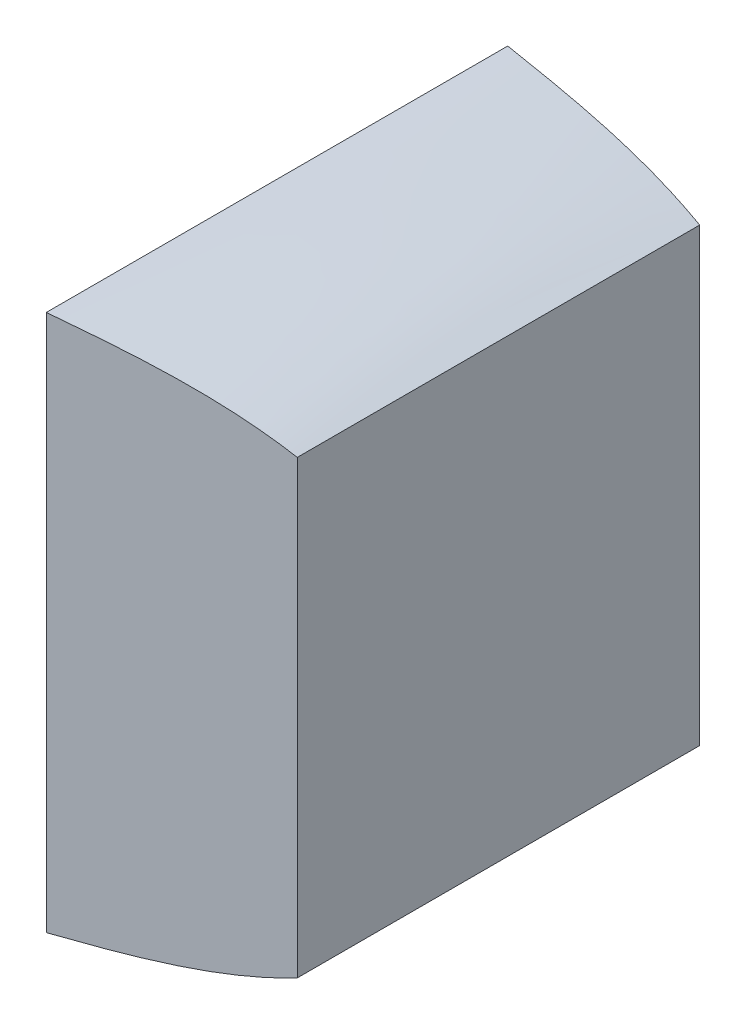
ISO-10303-21;
HEADER;
FILE_DESCRIPTION(('STEP AP214'),'2;1');
FILE_NAME('part.step','',(''),(''),'','','');
FILE_SCHEMA(('AUTOMOTIVE_DESIGN { 1 0 10303 214 1 1 1 1 }'));
ENDSEC;
DATA;
#1=APPLICATION_CONTEXT('core data for automotive mechanical design processes');
#2=APPLICATION_PROTOCOL_DEFINITION('international standard','automotive_design',2000,#1);
#3=PRODUCT_CONTEXT('',#1,'mechanical');
#4=PRODUCT('Part','Part','',(#3));
#5=PRODUCT_RELATED_PRODUCT_CATEGORY('part','',(#4));
#6=PRODUCT_DEFINITION_FORMATION('','',#4);
#7=PRODUCT_DEFINITION_CONTEXT('part definition',#1,'design');
#8=PRODUCT_DEFINITION('design','',#6,#7);
#9=PRODUCT_DEFINITION_SHAPE('','',#8);
#10=(LENGTH_UNIT() NAMED_UNIT(*) SI_UNIT(.MILLI.,.METRE.));
#11=(NAMED_UNIT(*) PLANE_ANGLE_UNIT() SI_UNIT($,.RADIAN.));
#12=(NAMED_UNIT(*) SI_UNIT($,.STERADIAN.) SOLID_ANGLE_UNIT());
#13=UNCERTAINTY_MEASURE_WITH_UNIT(LENGTH_MEASURE(1.E-05),#10,'distance_accuracy_value','');
#14=(GEOMETRIC_REPRESENTATION_CONTEXT(3) GLOBAL_UNCERTAINTY_ASSIGNED_CONTEXT((#13)) GLOBAL_UNIT_ASSIGNED_CONTEXT((#10,
#11,#12)) REPRESENTATION_CONTEXT('',''));
#15=CARTESIAN_POINT('',(0.,0.,0.));
#16=DIRECTION('',(0.,0.,1.));
#17=DIRECTION('',(1.,0.,0.));
#18=AXIS2_PLACEMENT_3D('',#15,#16,#17);
#19=CARTESIAN_POINT('',(120.,0.,0.));
#20=DIRECTION('',(-1.,0.,0.));
#21=DIRECTION('',(0.,0.,1.));
#22=AXIS2_PLACEMENT_3D('',#19,#20,#21);
#23=PLANE('',#22);
#24=DIRECTION('',(0.,0.,1.));
#25=VECTOR('',#24,1.);
#26=CARTESIAN_POINT('',(120.,129.5,109.));
#27=LINE('',#26,#25);
#28=CARTESIAN_POINT('',(120.,129.5,-109.));
#29=VERTEX_POINT('',#28);
#30=CARTESIAN_POINT('',(120.,129.5,109.));
#31=VERTEX_POINT('',#30);
#32=EDGE_CURVE('E221',#29,#31,#27,.T.);
#33=ORIENTED_EDGE('',*,*,#32,.T.);
#34=DIRECTION('',(0.,-1.,0.));
#35=VECTOR('',#34,1.);
#36=CARTESIAN_POINT('',(120.,129.5,109.));
#37=LINE('',#36,#35);
#38=CARTESIAN_POINT('',(120.,-114.75,109.));
#39=VERTEX_POINT('',#38);
#40=EDGE_CURVE('E223',#31,#39,#37,.T.);
#41=ORIENTED_EDGE('',*,*,#40,.T.);
#42=DIRECTION('',(0.,0.,-1.));
#43=VECTOR('',#42,1.);
#44=CARTESIAN_POINT('',(120.,-114.75,109.));
#45=LINE('',#44,#43);
#46=CARTESIAN_POINT('',(120.,-114.75,-109.));
#47=VERTEX_POINT('',#46);
#48=EDGE_CURVE('E184',#39,#47,#45,.T.);
#49=ORIENTED_EDGE('',*,*,#48,.T.);
#50=DIRECTION('',(0.,1.,0.));
#51=VECTOR('',#50,1.);
#52=CARTESIAN_POINT('',(120.,129.5,-109.));
#53=LINE('',#52,#51);
#54=EDGE_CURVE('E189',#47,#29,#53,.T.);
#55=ORIENTED_EDGE('',*,*,#54,.T.);
#56=EDGE_LOOP('',(#33,#41,#49,#55));
#57=FACE_BOUND('',#56,.T.);
#58=ADVANCED_FACE('F147',(#57),#23,.F.);
#59=CARTESIAN_POINT('',(0.,0.,0.));
#60=DIRECTION('',(1.,0.,0.));
#61=DIRECTION('',(0.,0.,-1.));
#62=AXIS2_PLACEMENT_3D('',#59,#60,#61);
#63=PLANE('',#62);
#64=DIRECTION('',(0.,-1.,0.));
#65=VECTOR('',#64,1.);
#66=CARTESIAN_POINT('',(0.,145.5,125.));
#67=LINE('',#66,#65);
#68=CARTESIAN_POINT('',(0.,145.5,125.));
#69=VERTEX_POINT('',#68);
#70=CARTESIAN_POINT('',(0.,-145.5,125.));
#71=VERTEX_POINT('',#70);
#72=EDGE_CURVE('E202',#69,#71,#67,.T.);
#73=ORIENTED_EDGE('',*,*,#72,.F.);
#74=DIRECTION('',(0.,0.,1.));
#75=VECTOR('',#74,1.);
#76=CARTESIAN_POINT('',(0.,145.5,125.));
#77=LINE('',#76,#75);
#78=CARTESIAN_POINT('',(0.,145.5,-125.));
#79=VERTEX_POINT('',#78);
#80=EDGE_CURVE('E15',#79,#69,#77,.T.);
#81=ORIENTED_EDGE('',*,*,#80,.F.);
#82=DIRECTION('',(0.,1.,0.));
#83=VECTOR('',#82,1.);
#84=CARTESIAN_POINT('',(0.,145.5,-125.));
#85=LINE('',#84,#83);
#86=CARTESIAN_POINT('',(0.,-145.5,-125.));
#87=VERTEX_POINT('',#86);
#88=EDGE_CURVE('E158',#87,#79,#85,.T.);
#89=ORIENTED_EDGE('',*,*,#88,.F.);
#90=DIRECTION('',(0.,0.,-1.));
#91=VECTOR('',#90,1.);
#92=CARTESIAN_POINT('',(0.,-145.5,125.));
#93=LINE('',#92,#91);
#94=EDGE_CURVE('E167',#71,#87,#93,.T.);
#95=ORIENTED_EDGE('',*,*,#94,.F.);
#96=EDGE_LOOP('',(#73,#81,#89,#95));
#97=FACE_BOUND('',#96,.T.);
#98=ADVANCED_FACE('F200',(#97),#63,.F.);
#99=CARTESIAN_POINT('',(0.,-145.5,125.));
#100=CARTESIAN_POINT('',(13.0891040272464,-143.424539708883,123.293126776865));
#101=CARTESIAN_POINT('',(54.3080287417542,-136.65022643676,117.959793443532));
#102=CARTESIAN_POINT('',(94.731450249176,-126.291251244197,112.626460110199));
#103=CARTESIAN_POINT('',(120.,-114.75,109.));
#104=CARTESIAN_POINT('',(0.,-145.5,114.443669442892));
#105=CARTESIAN_POINT('',(13.0916315601428,-143.495090170189,112.906665428313));
#106=CARTESIAN_POINT('',(54.3261197229623,-136.929789132152,108.104109132206));
#107=CARTESIAN_POINT('',(94.7443238380566,-126.570028362689,103.301552836099));
#108=CARTESIAN_POINT('',(120.,-114.75,100.036000554571));
#109=CARTESIAN_POINT('',(0.,-145.5,93.4739085944704));
#110=CARTESIAN_POINT('',(13.0962471571785,-143.623924299521,92.2489590891581));
#111=CARTESIAN_POINT('',(54.3591561591465,-137.440306225704,88.4214551247255));
#112=CARTESIAN_POINT('',(94.7678326512393,-127.079110892751,84.5939511602929));
#113=CARTESIAN_POINT('',(120.,-114.75,81.9913967011725));
#114=CARTESIAN_POINT('',(0.,-145.5,62.277139001304));
#115=CARTESIAN_POINT('',(13.1015635247602,-143.772318880611,61.4685437253229));
#116=CARTESIAN_POINT('',(54.3972084061225,-138.028333409412,58.9419892746967));
#117=CARTESIAN_POINT('',(94.7949107283164,-127.665485708027,56.4154348240705));
#118=CARTESIAN_POINT('',(120.,-114.75,54.6974756494253));
#119=CARTESIAN_POINT('',(0.,-145.5,31.1813203106448));
#120=CARTESIAN_POINT('',(13.1049842426695,-143.867800615721,30.7684000788011));
#121=CARTESIAN_POINT('',(54.4216924171921,-138.406688571574,29.4781805085065));
#122=CARTESIAN_POINT('',(94.8123336137326,-128.042777684434,28.187960938212));
#123=CARTESIAN_POINT('',(120.,-114.75,27.3106615997612));
#124=CARTESIAN_POINT('',(0.,-145.5,10.4166666666667));
#125=CARTESIAN_POINT('',(13.1058085403606,-143.890809053094,10.2744272314054));
#126=CARTESIAN_POINT('',(54.4275923815644,-138.497861622038,9.82998278696101));
#127=CARTESIAN_POINT('',(94.8165320435948,-128.133694536758,9.38553834251658));
#128=CARTESIAN_POINT('',(120.,-114.75,9.08333333333336));
#129=CARTESIAN_POINT('',(0.,-145.5,0.));
#130=CARTESIAN_POINT('',(13.1058085403606,-143.890809053094,0.));
#131=CARTESIAN_POINT('',(54.4275923815644,-138.497861622038,0.));
#132=CARTESIAN_POINT('',(94.8165320435948,-128.133694536758,0.));
#133=CARTESIAN_POINT('',(120.,-114.75,0.));
#134=CARTESIAN_POINT('',(0.,-145.5,-10.4166666666667));
#135=CARTESIAN_POINT('',(13.1058085403606,-143.890809053094,-10.2744272314054));
#136=CARTESIAN_POINT('',(54.4275923815644,-138.497861622038,-9.829982786961));
#137=CARTESIAN_POINT('',(94.8165320435948,-128.133694536758,-9.38553834251656));
#138=CARTESIAN_POINT('',(120.,-114.75,-9.08333333333334));
#139=CARTESIAN_POINT('',(0.,-145.5,-31.1813203106449));
#140=CARTESIAN_POINT('',(13.1049842426695,-143.867800615721,-30.7684000788011));
#141=CARTESIAN_POINT('',(54.4216924171921,-138.406688571574,-29.4781805085066));
#142=CARTESIAN_POINT('',(94.8123336137326,-128.042777684434,-28.187960938212));
#143=CARTESIAN_POINT('',(120.,-114.75,-27.3106615997613));
#144=CARTESIAN_POINT('',(0.,-145.5,-62.277139001304));
#145=CARTESIAN_POINT('',(13.1015635247602,-143.772318880611,-61.4685437253229));
#146=CARTESIAN_POINT('',(54.3972084061225,-138.028333409411,-58.9419892746967));
#147=CARTESIAN_POINT('',(94.7949107283164,-127.665485708027,-56.4154348240705));
#148=CARTESIAN_POINT('',(120.,-114.75,-54.6974756494253));
#149=CARTESIAN_POINT('',(0.,-145.5,-93.4739085944704));
#150=CARTESIAN_POINT('',(13.0962471571785,-143.623924299522,-92.2489590891582));
#151=CARTESIAN_POINT('',(54.3591561591465,-137.440306225705,-88.4214551247256));
#152=CARTESIAN_POINT('',(94.7678326512394,-127.079110892751,-84.593951160293));
#153=CARTESIAN_POINT('',(120.,-114.75,-81.9913967011726));
#154=CARTESIAN_POINT('',(0.,-145.5,-114.443669442892));
#155=CARTESIAN_POINT('',(13.0916315601428,-143.495090170189,-112.906665428313));
#156=CARTESIAN_POINT('',(54.3261197229622,-136.929789132152,-108.104109132206));
#157=CARTESIAN_POINT('',(94.7443238380566,-126.570028362689,-103.301552836099));
#158=CARTESIAN_POINT('',(120.,-114.75,-100.036000554571));
#159=CARTESIAN_POINT('',(0.,-145.5,-125.));
#160=CARTESIAN_POINT('',(13.0891040272464,-143.424539708883,-123.293126776865));
#161=CARTESIAN_POINT('',(54.3080287417542,-136.65022643676,-117.959793443532));
#162=CARTESIAN_POINT('',(94.7314502491761,-126.291251244197,-112.626460110199));
#163=CARTESIAN_POINT('',(120.,-114.75,-109.));
#164=B_SPLINE_SURFACE_WITH_KNOTS('',3,3,((#99,#100,#101,#102,#103),(#104,#105,#106,#107,#108),
(#109,#110,#111,#112,#113),(#114,#115,#116,#117,#118),(#119,#120,#121,#122,#123),(#124,#125,
#126,#127,#128),(#129,#130,#131,#132,#133),(#134,#135,#136,#137,#138),(#139,#140,#141,#142,
#143),(#144,#145,#146,#147,#148),(#149,#150,#151,#152,#153),(#154,#155,#156,#157,#158),(#159,
#160,#161,#162,#163)),.UNSPECIFIED.,.F.,.F.,.F.,(4,1,1,1,3,1,1,1,4),(4,1,4),(0.766571629366526,
0.79575017569571,0.824928722024894,0.854107268354079,0.883285814683263,0.912464361012447,
0.941642907341631,0.970821453670816,1.),(0.,0.320038729337755,1.),.UNSPECIFIED.);
#165=CARTESIAN_POINT('',(0.,-145.5,-125.));
#166=CARTESIAN_POINT('',(13.0891040272464,-143.424539708883,-123.293126776865));
#167=CARTESIAN_POINT('',(54.3080287417542,-136.65022643676,-117.959793443532));
#168=CARTESIAN_POINT('',(94.7314502491761,-126.291251244197,-112.626460110199));
#169=CARTESIAN_POINT('',(120.,-114.75,-109.));
#170=B_SPLINE_CURVE_WITH_KNOTS('',3,(#165,#166,#167,#168,#169),.UNSPECIFIED.,.F.,.F.,(4,1,4),
(0.,0.320038729337755,1.),.UNSPECIFIED.);
#171=EDGE_CURVE('E216',#87,#47,#170,.T.);
#172=CARTESIAN_POINT('',(0.,-145.5,125.));
#173=CARTESIAN_POINT('',(13.0891040272464,-143.424539708883,123.293126776865));
#174=CARTESIAN_POINT('',(54.3080287417542,-136.65022643676,117.959793443532));
#175=CARTESIAN_POINT('',(94.731450249176,-126.291251244197,112.626460110199));
#176=CARTESIAN_POINT('',(120.,-114.75,109.));
#177=B_SPLINE_CURVE_WITH_KNOTS('',3,(#172,#173,#174,#175,#176),.UNSPECIFIED.,.F.,.F.,(4,1,4),
(0.,0.320038729337755,1.),.UNSPECIFIED.);
#178=EDGE_CURVE('E225',#71,#39,#177,.T.);
#179=ORIENTED_EDGE('',*,*,#94,.T.);
#180=ORIENTED_EDGE('',*,*,#171,.T.);
#181=ORIENTED_EDGE('',*,*,#48,.F.);
#182=ORIENTED_EDGE('',*,*,#178,.F.);
#183=EDGE_LOOP('',(#179,#180,#181,#182));
#184=FACE_BOUND('',#183,.T.);
#185=ADVANCED_FACE('F265',(#184),#164,.T.);
#186=CARTESIAN_POINT('',(0.,145.5,125.));
#187=CARTESIAN_POINT('',(13.0014903659114,145.033730655789,123.293126776865));
#188=CARTESIAN_POINT('',(53.6809282585079,143.469849566995,117.959793443532));
#189=CARTESIAN_POINT('',(94.2852039281364,138.218260418227,112.626460110199));
#190=CARTESIAN_POINT('',(120.,129.5,109.));
#191=CARTESIAN_POINT('',(0.,121.25,125.));
#192=CARTESIAN_POINT('',(13.0072631737381,121.038201409973,123.293126776865));
#193=CARTESIAN_POINT('',(53.7222475062445,120.295553882622,117.959793443532));
#194=CARTESIAN_POINT('',(94.3146068113795,116.344370078578,112.626460110199));
#195=CARTESIAN_POINT('',(120.,109.145833333333,109.));
#196=CARTESIAN_POINT('',(0.,72.7500000000001,125.));
#197=CARTESIAN_POINT('',(13.0211012853184,72.9831529914806,123.293126776865));
#198=CARTESIAN_POINT('',(53.8212946905186,73.6933965399663,117.959793443532));
#199=CARTESIAN_POINT('',(94.3850890431311,72.3437359509502,112.626460110199));
#200=CARTESIAN_POINT('',(120.,68.4375000000001,109.));
#201=CARTESIAN_POINT('',(0.,0.,125.));
#202=CARTESIAN_POINT('',(13.0452971965789,0.804595473452866,123.293126776865));
#203=CARTESIAN_POINT('',(53.9944785001309,3.40981156511738,117.959793443532));
#204=CARTESIAN_POINT('',(94.508327088656,5.96350458701466,112.626460110199));
#205=CARTESIAN_POINT('',(120.,7.37500000000002,109.));
#206=CARTESIAN_POINT('',(0.,-72.75,125.));
#207=CARTESIAN_POINT('',(13.0694931078395,-71.3739620445749,123.293126776865));
#208=CARTESIAN_POINT('',(54.1676623097435,-66.8737734097315,117.959793443532));
#209=CARTESIAN_POINT('',(94.6315651341814,-60.4167267769209,112.626460110199));
#210=CARTESIAN_POINT('',(120.,-53.6875,109.));
#211=CARTESIAN_POINT('',(0.,-121.25,125.));
#212=CARTESIAN_POINT('',(13.0833312194197,-119.429010463067,123.293126776865));
#213=CARTESIAN_POINT('',(54.2667094940175,-113.475930752387,117.959793443532));
#214=CARTESIAN_POINT('',(94.7020473659329,-104.417360904548,112.626460110199));
#215=CARTESIAN_POINT('',(120.,-94.3958333333333,109.));
#216=CARTESIAN_POINT('',(0.,-145.5,125.));
#217=CARTESIAN_POINT('',(13.0891040272464,-143.424539708883,123.293126776865));
#218=CARTESIAN_POINT('',(54.3080287417542,-136.65022643676,117.959793443532));
#219=CARTESIAN_POINT('',(94.731450249176,-126.291251244197,112.626460110199));
#220=CARTESIAN_POINT('',(120.,-114.75,109.));
#221=B_SPLINE_SURFACE_WITH_KNOTS('',3,3,((#186,#187,#188,#189,#190),(#191,#192,#193,#194,#195),
(#196,#197,#198,#199,#200),(#201,#202,#203,#204,#205),(#206,#207,#208,#209,#210),(#211,#212,
#213,#214,#215),(#216,#217,#218,#219,#220)),.UNSPECIFIED.,.F.,.F.,.F.,(4,1,1,1,4),(4,1,4),(0.5,
0.566642907341631,0.633285814683263,0.699928722024894,0.766571629366526),(0.,0.320038729337755,
1.),.UNSPECIFIED.);
#222=CARTESIAN_POINT('',(0.,145.5,125.));
#223=CARTESIAN_POINT('',(13.0014903659114,145.033730655789,123.293126776865));
#224=CARTESIAN_POINT('',(53.6809282585079,143.469849566995,117.959793443532));
#225=CARTESIAN_POINT('',(94.2852039281364,138.218260418227,112.626460110199));
#226=CARTESIAN_POINT('',(120.,129.5,109.));
#227=B_SPLINE_CURVE_WITH_KNOTS('',3,(#222,#223,#224,#225,#226),.UNSPECIFIED.,.F.,.F.,(4,1,4),
(0.,0.320038729337755,1.),.UNSPECIFIED.);
#228=EDGE_CURVE('E196',#69,#31,#227,.T.);
#229=ORIENTED_EDGE('',*,*,#72,.T.);
#230=ORIENTED_EDGE('',*,*,#178,.T.);
#231=ORIENTED_EDGE('',*,*,#40,.F.);
#232=ORIENTED_EDGE('',*,*,#228,.F.);
#233=EDGE_LOOP('',(#229,#230,#231,#232));
#234=FACE_BOUND('',#233,.T.);
#235=ADVANCED_FACE('F255',(#234),#221,.T.);
#236=CARTESIAN_POINT('',(0.,145.5,-125.));
#237=CARTESIAN_POINT('',(13.0014903659114,145.033730655789,-123.293126776865));
#238=CARTESIAN_POINT('',(53.6809282585079,143.469849566995,-117.959793443532));
#239=CARTESIAN_POINT('',(94.2852039281364,138.218260418227,-112.626460110199));
#240=CARTESIAN_POINT('',(120.,129.5,-109.));
#241=CARTESIAN_POINT('',(0.,145.5,-114.443669442892));
#242=CARTESIAN_POINT('',(12.998962833015,145.104281117095,-112.906665428313));
#243=CARTESIAN_POINT('',(53.6628372772998,143.749412262387,-108.104109132206));
#244=CARTESIAN_POINT('',(94.2723303392558,138.497037536718,-103.301552836099));
#245=CARTESIAN_POINT('',(120.,129.5,-100.036000554571));
#246=CARTESIAN_POINT('',(0.,145.5,-93.4739085944704));
#247=CARTESIAN_POINT('',(12.9943472359793,145.233115246427,-92.2489590891581));
#248=CARTESIAN_POINT('',(53.6298008411154,144.259929355939,-88.4214551247255));
#249=CARTESIAN_POINT('',(94.2488215260729,139.00612006678,-84.5939511602929));
#250=CARTESIAN_POINT('',(120.,129.5,-81.9913967011725));
#251=CARTESIAN_POINT('',(0.,145.5,-62.2771390013041));
#252=CARTESIAN_POINT('',(12.9890308683976,145.381509827517,-61.468543725323));
#253=CARTESIAN_POINT('',(53.5917485941396,144.847956539646,-58.9419892746968));
#254=CARTESIAN_POINT('',(94.2217434489962,139.592494882056,-56.4154348240705));
#255=CARTESIAN_POINT('',(120.,129.5,-54.6974756494253));
#256=CARTESIAN_POINT('',(0.,145.5,-31.1813203106449));
#257=CARTESIAN_POINT('',(12.9856101504883,145.476991562627,-30.7684000788011));
#258=CARTESIAN_POINT('',(53.5672645830699,145.226311701809,-29.4781805085065));
#259=CARTESIAN_POINT('',(94.2043205635798,139.969786858463,-28.1879609382119));
#260=CARTESIAN_POINT('',(120.,129.5,-27.3106615997611));
#261=CARTESIAN_POINT('',(0.,145.5,-10.4166666666667));
#262=CARTESIAN_POINT('',(12.9847858527973,145.5,-10.2744272314055));
#263=CARTESIAN_POINT('',(53.5613646186976,145.317484752272,-9.82998278696101));
#264=CARTESIAN_POINT('',(94.2001221337177,140.060703710787,-9.38553834251656));
#265=CARTESIAN_POINT('',(120.,129.5,-9.08333333333334));
#266=CARTESIAN_POINT('',(0.,145.5,10.4166666666667));
#267=CARTESIAN_POINT('',(12.9847858527973,145.5,10.2744272314054));
#268=CARTESIAN_POINT('',(53.5613646186976,145.317484752272,9.82998278696099));
#269=CARTESIAN_POINT('',(94.2001221337177,140.060703710787,9.38553834251654));
#270=CARTESIAN_POINT('',(120.,129.5,9.08333333333332));
#271=CARTESIAN_POINT('',(0.,145.5,31.1813203106448));
#272=CARTESIAN_POINT('',(12.9856101504883,145.476991562627,30.7684000788011));
#273=CARTESIAN_POINT('',(53.5672645830699,145.226311701809,29.4781805085065));
#274=CARTESIAN_POINT('',(94.2043205635798,139.969786858463,28.187960938212));
#275=CARTESIAN_POINT('',(120.,129.5,27.3106615997612));
#276=CARTESIAN_POINT('',(0.,145.5,62.2771390013041));
#277=CARTESIAN_POINT('',(12.9890308683976,145.381509827517,61.468543725323));
#278=CARTESIAN_POINT('',(53.5917485941396,144.847956539646,58.9419892746968));
#279=CARTESIAN_POINT('',(94.2217434489961,139.592494882056,56.4154348240705));
#280=CARTESIAN_POINT('',(120.,129.5,54.6974756494254));
#281=CARTESIAN_POINT('',(0.,145.5,93.4739085944704));
#282=CARTESIAN_POINT('',(12.9943472359793,145.233115246427,92.2489590891581));
#283=CARTESIAN_POINT('',(53.6298008411154,144.259929355939,88.4214551247255));
#284=CARTESIAN_POINT('',(94.2488215260729,139.00612006678,84.5939511602929));
#285=CARTESIAN_POINT('',(120.,129.5,81.9913967011725));
#286=CARTESIAN_POINT('',(0.,145.5,114.443669442892));
#287=CARTESIAN_POINT('',(12.998962833015,145.104281117095,112.906665428313));
#288=CARTESIAN_POINT('',(53.6628372772998,143.749412262387,108.104109132206));
#289=CARTESIAN_POINT('',(94.2723303392558,138.497037536718,103.301552836099));
#290=CARTESIAN_POINT('',(120.,129.5,100.036000554571));
#291=CARTESIAN_POINT('',(0.,145.5,125.));
#292=CARTESIAN_POINT('',(13.0014903659114,145.033730655789,123.293126776865));
#293=CARTESIAN_POINT('',(53.6809282585079,143.469849566995,117.959793443532));
#294=CARTESIAN_POINT('',(94.2852039281364,138.218260418227,112.626460110199));
#295=CARTESIAN_POINT('',(120.,129.5,109.));
#296=B_SPLINE_SURFACE_WITH_KNOTS('',3,3,((#236,#237,#238,#239,#240),(#241,#242,#243,#244,#245),
(#246,#247,#248,#249,#250),(#251,#252,#253,#254,#255),(#256,#257,#258,#259,#260),(#261,#262,
#263,#264,#265),(#266,#267,#268,#269,#270),(#271,#272,#273,#274,#275),(#276,#277,#278,#279,
#280),(#281,#282,#283,#284,#285),(#286,#287,#288,#289,#290),(#291,#292,#293,#294,#295)),
.UNSPECIFIED.,.F.,.F.,.F.,(4,1,1,1,2,1,1,1,4),(4,1,4),(0.266571629366526,0.29575017569571,
0.324928722024894,0.354107268354079,0.383285814683263,0.412464361012447,0.441642907341632,
0.470821453670816,0.5),(0.,0.320038729337755,1.),.UNSPECIFIED.);
#297=CARTESIAN_POINT('',(0.,145.5,-125.));
#298=CARTESIAN_POINT('',(13.0014903659114,145.033730655789,-123.293126776865));
#299=CARTESIAN_POINT('',(53.6809282585079,143.469849566995,-117.959793443532));
#300=CARTESIAN_POINT('',(94.2852039281364,138.218260418227,-112.626460110199));
#301=CARTESIAN_POINT('',(120.,129.5,-109.));
#302=B_SPLINE_CURVE_WITH_KNOTS('',3,(#297,#298,#299,#300,#301),.UNSPECIFIED.,.F.,.F.,(4,1,4),
(0.,0.320038729337755,1.),.UNSPECIFIED.);
#303=EDGE_CURVE('E214',#79,#29,#302,.T.);
#304=ORIENTED_EDGE('',*,*,#80,.T.);
#305=ORIENTED_EDGE('',*,*,#228,.T.);
#306=ORIENTED_EDGE('',*,*,#32,.F.);
#307=ORIENTED_EDGE('',*,*,#303,.F.);
#308=EDGE_LOOP('',(#304,#305,#306,#307));
#309=FACE_BOUND('',#308,.T.);
#310=ADVANCED_FACE('F220',(#309),#296,.T.);
#311=CARTESIAN_POINT('',(0.,-145.5,-125.));
#312=CARTESIAN_POINT('',(13.0891040272464,-143.424539708883,-123.293126776865));
#313=CARTESIAN_POINT('',(54.3080287417542,-136.65022643676,-117.959793443532));
#314=CARTESIAN_POINT('',(94.7314502491761,-126.291251244197,-112.626460110199));
#315=CARTESIAN_POINT('',(120.,-114.75,-109.));
#316=CARTESIAN_POINT('',(0.,-121.25,-125.));
#317=CARTESIAN_POINT('',(13.0833312194197,-119.429010463067,-123.293126776865));
#318=CARTESIAN_POINT('',(54.2667094940175,-113.475930752387,-117.959793443532));
#319=CARTESIAN_POINT('',(94.702047365933,-104.417360904548,-112.626460110199));
#320=CARTESIAN_POINT('',(120.,-94.3958333333332,-109.));
#321=CARTESIAN_POINT('',(0.,-72.75,-125.));
#322=CARTESIAN_POINT('',(13.0694931078395,-71.3739620445749,-123.293126776866));
#323=CARTESIAN_POINT('',(54.1676623097435,-66.8737734097315,-117.959793443532));
#324=CARTESIAN_POINT('',(94.6315651341815,-60.4167267769208,-112.626460110199));
#325=CARTESIAN_POINT('',(120.,-53.6874999999999,-109.));
#326=CARTESIAN_POINT('',(0.,0.,-125.));
#327=CARTESIAN_POINT('',(13.0452971965789,0.804595473452931,-123.293126776865));
#328=CARTESIAN_POINT('',(53.994478500131,3.40981156511744,-117.959793443532));
#329=CARTESIAN_POINT('',(94.5083270886563,5.96350458701471,-112.626460110199));
#330=CARTESIAN_POINT('',(120.,7.37500000000007,-109.));
#331=CARTESIAN_POINT('',(0.,72.75,-125.));
#332=CARTESIAN_POINT('',(13.0211012853184,72.9831529914806,-123.293126776865));
#333=CARTESIAN_POINT('',(53.8212946905186,73.6933965399662,-117.959793443532));
#334=CARTESIAN_POINT('',(94.3850890431311,72.3437359509502,-112.626460110199));
#335=CARTESIAN_POINT('',(120.,68.4375,-109.));
#336=CARTESIAN_POINT('',(0.,121.25,-125.));
#337=CARTESIAN_POINT('',(13.0072631737381,121.038201409973,-123.293126776865));
#338=CARTESIAN_POINT('',(53.7222475062445,120.295553882622,-117.959793443532));
#339=CARTESIAN_POINT('',(94.3146068113795,116.344370078578,-112.626460110199));
#340=CARTESIAN_POINT('',(120.,109.145833333333,-109.));
#341=CARTESIAN_POINT('',(0.,145.5,-125.));
#342=CARTESIAN_POINT('',(13.0014903659114,145.033730655789,-123.293126776865));
#343=CARTESIAN_POINT('',(53.6809282585079,143.469849566995,-117.959793443532));
#344=CARTESIAN_POINT('',(94.2852039281364,138.218260418227,-112.626460110199));
#345=CARTESIAN_POINT('',(120.,129.5,-109.));
#346=B_SPLINE_SURFACE_WITH_KNOTS('',3,3,((#311,#312,#313,#314,#315),(#316,#317,#318,#319,#320),
(#321,#322,#323,#324,#325),(#326,#327,#328,#329,#330),(#331,#332,#333,#334,#335),(#336,#337,
#338,#339,#340),(#341,#342,#343,#344,#345)),.UNSPECIFIED.,.F.,.F.,.F.,(4,1,1,1,4),(4,1,4),(0.,
0.0666429073416315,0.133285814683263,0.199928722024894,0.266571629366526),(0.,0.320038729337755,
1.),.UNSPECIFIED.);
#347=ORIENTED_EDGE('',*,*,#88,.T.);
#348=ORIENTED_EDGE('',*,*,#303,.T.);
#349=ORIENTED_EDGE('',*,*,#54,.F.);
#350=ORIENTED_EDGE('',*,*,#171,.F.);
#351=EDGE_LOOP('',(#347,#348,#349,#350));
#352=FACE_BOUND('',#351,.T.);
#353=ADVANCED_FACE('F213',(#352),#346,.T.);
#354=CLOSED_SHELL('',(#58,#98,#185,#235,#310,#353));
#355=MANIFOLD_SOLID_BREP('B2',#354);
#356=ADVANCED_BREP_SHAPE_REPRESENTATION('',(#18,#355),#14);
#357=SHAPE_DEFINITION_REPRESENTATION(#9,#356);
ENDSEC;
END-ISO-10303-21;
